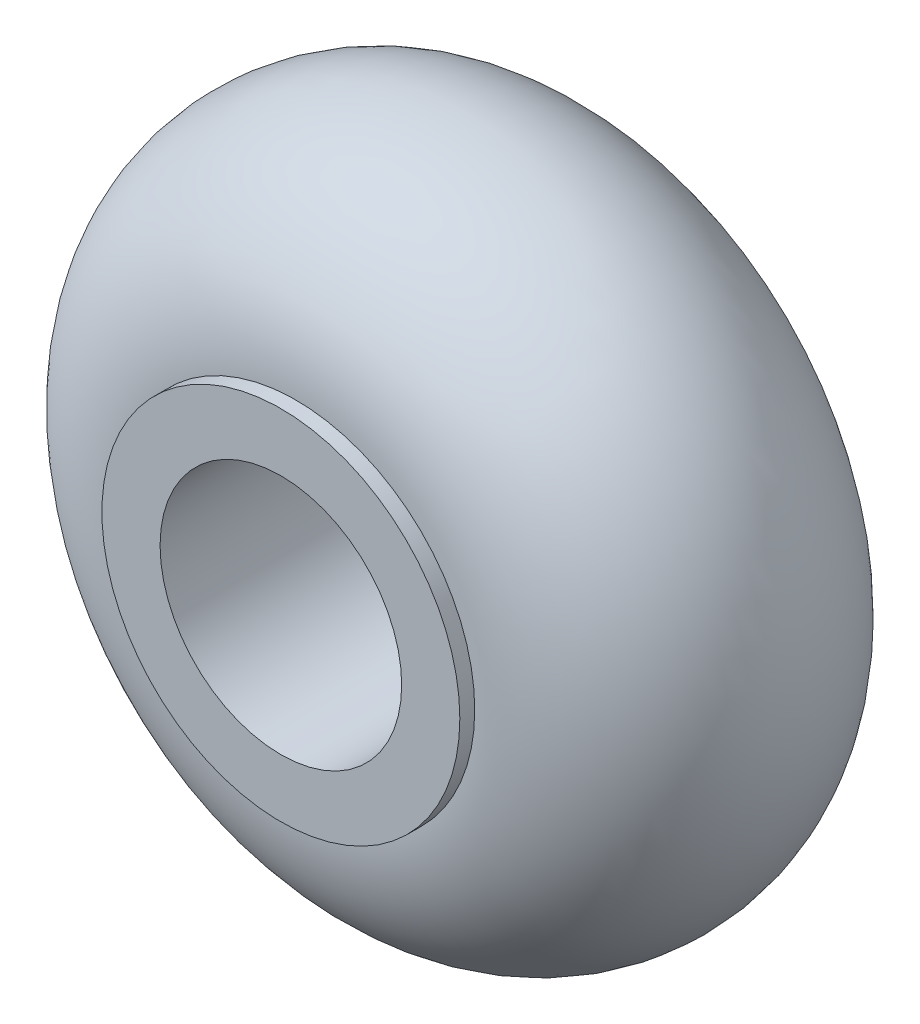
ISO-10303-21;
HEADER;
FILE_DESCRIPTION(('STEP AP214'),'2;1');
FILE_NAME('part.step','',(''),(''),'','','');
FILE_SCHEMA(('AUTOMOTIVE_DESIGN { 1 0 10303 214 1 1 1 1 }'));
ENDSEC;
DATA;
#1=APPLICATION_CONTEXT('core data for automotive mechanical design processes');
#2=APPLICATION_PROTOCOL_DEFINITION('international standard','automotive_design',2000,#1);
#3=PRODUCT_CONTEXT('',#1,'mechanical');
#4=PRODUCT('Part','Part','',(#3));
#5=PRODUCT_RELATED_PRODUCT_CATEGORY('part','',(#4));
#6=PRODUCT_DEFINITION_FORMATION('','',#4);
#7=PRODUCT_DEFINITION_CONTEXT('part definition',#1,'design');
#8=PRODUCT_DEFINITION('design','',#6,#7);
#9=PRODUCT_DEFINITION_SHAPE('','',#8);
#10=(LENGTH_UNIT() NAMED_UNIT(*) SI_UNIT(.MILLI.,.METRE.));
#11=(NAMED_UNIT(*) PLANE_ANGLE_UNIT() SI_UNIT($,.RADIAN.));
#12=(NAMED_UNIT(*) SI_UNIT($,.STERADIAN.) SOLID_ANGLE_UNIT());
#13=UNCERTAINTY_MEASURE_WITH_UNIT(LENGTH_MEASURE(1.E-05),#10,'distance_accuracy_value','');
#14=(GEOMETRIC_REPRESENTATION_CONTEXT(3) GLOBAL_UNCERTAINTY_ASSIGNED_CONTEXT((#13)) GLOBAL_UNIT_ASSIGNED_CONTEXT((#10,
#11,#12)) REPRESENTATION_CONTEXT('',''));
#15=CARTESIAN_POINT('',(0.,0.,0.));
#16=DIRECTION('',(0.,0.,1.));
#17=DIRECTION('',(1.,0.,0.));
#18=AXIS2_PLACEMENT_3D('',#15,#16,#17);
#19=CARTESIAN_POINT('',(0.,0.,0.));
#20=DIRECTION('',(0.,0.,1.));
#21=DIRECTION('',(1.,0.,0.));
#22=AXIS2_PLACEMENT_3D('',#19,#20,#21);
#23=TOROIDAL_SURFACE('',#22,6.08173076923084,5.50060723180987);
#24=CARTESIAN_POINT('',(0.,0.,5.5));
#25=DIRECTION('',(0.,0.,1.));
#26=DIRECTION('',(1.,0.,0.));
#27=AXIS2_PLACEMENT_3D('',#24,#25,#26);
#28=CIRCLE('',#27,6.);
#29=CARTESIAN_POINT('',(6.,0.,5.5));
#30=VERTEX_POINT('',#29);
#31=EDGE_CURVE('E10',#30,#30,#28,.T.);
#32=ORIENTED_EDGE('',*,*,#31,.F.);
#33=EDGE_LOOP('',(#32));
#34=FACE_BOUND('',#33,.T.);
#35=CARTESIAN_POINT('',(0.,0.,-5.5));
#36=DIRECTION('',(0.,0.,1.));
#37=DIRECTION('',(1.,0.,0.));
#38=AXIS2_PLACEMENT_3D('',#35,#36,#37);
#39=CIRCLE('',#38,6.00000000000012);
#40=CARTESIAN_POINT('',(6.00000000000012,0.,-5.5));
#41=VERTEX_POINT('',#40);
#42=EDGE_CURVE('E64',#41,#41,#39,.T.);
#43=ORIENTED_EDGE('',*,*,#42,.T.);
#44=EDGE_LOOP('',(#43));
#45=FACE_BOUND('',#44,.T.);
#46=ADVANCED_FACE('F37',(#34,#45),#23,.T.);
#47=CARTESIAN_POINT('',(0.,0.,10.3653846153846));
#48=DIRECTION('',(0.,0.,1.));
#49=DIRECTION('',(1.,0.,0.));
#50=AXIS2_PLACEMENT_3D('',#47,#48,#49);
#51=CYLINDRICAL_SURFACE('',#50,6.);
#52=CARTESIAN_POINT('',(0.,0.,6.));
#53=DIRECTION('',(0.,0.,1.));
#54=DIRECTION('',(1.,0.,0.));
#55=AXIS2_PLACEMENT_3D('',#52,#53,#54);
#56=CIRCLE('',#55,6.);
#57=CARTESIAN_POINT('',(6.,0.,6.));
#58=VERTEX_POINT('',#57);
#59=EDGE_CURVE('E44',#58,#58,#56,.T.);
#60=ORIENTED_EDGE('',*,*,#59,.F.);
#61=EDGE_LOOP('',(#60));
#62=FACE_BOUND('',#61,.T.);
#63=ORIENTED_EDGE('',*,*,#31,.T.);
#64=EDGE_LOOP('',(#63));
#65=FACE_BOUND('',#64,.T.);
#66=ADVANCED_FACE('F90',(#62,#65),#51,.T.);
#67=CARTESIAN_POINT('',(0.,6.,6.));
#68=DIRECTION('',(0.,0.,-1.));
#69=DIRECTION('',(-1.,0.,0.));
#70=AXIS2_PLACEMENT_3D('',#67,#68,#69);
#71=PLANE('',#70);
#72=CARTESIAN_POINT('',(0.,0.,6.));
#73=DIRECTION('',(0.,0.,1.));
#74=DIRECTION('',(1.,0.,0.));
#75=AXIS2_PLACEMENT_3D('',#72,#73,#74);
#76=CIRCLE('',#75,4.05);
#77=CARTESIAN_POINT('',(4.05,0.,6.));
#78=VERTEX_POINT('',#77);
#79=EDGE_CURVE('E49',#78,#78,#76,.T.);
#80=ORIENTED_EDGE('',*,*,#79,.F.);
#81=EDGE_LOOP('',(#80));
#82=FACE_BOUND('',#81,.T.);
#83=ORIENTED_EDGE('',*,*,#59,.T.);
#84=EDGE_LOOP('',(#83));
#85=FACE_BOUND('',#84,.T.);
#86=ADVANCED_FACE('F85',(#82,#85),#71,.F.);
#87=CARTESIAN_POINT('',(0.,0.,10.3653846153846));
#88=DIRECTION('',(0.,0.,1.));
#89=DIRECTION('',(1.,0.,0.));
#90=AXIS2_PLACEMENT_3D('',#87,#88,#89);
#91=CYLINDRICAL_SURFACE('',#90,4.05);
#92=CARTESIAN_POINT('',(0.,0.,-6.00000000000001));
#93=DIRECTION('',(0.,0.,1.));
#94=DIRECTION('',(1.,0.,0.));
#95=AXIS2_PLACEMENT_3D('',#92,#93,#94);
#96=CIRCLE('',#95,4.05);
#97=CARTESIAN_POINT('',(4.05,0.,-6.00000000000001));
#98=VERTEX_POINT('',#97);
#99=EDGE_CURVE('E54',#98,#98,#96,.T.);
#100=ORIENTED_EDGE('',*,*,#99,.F.);
#101=EDGE_LOOP('',(#100));
#102=FACE_BOUND('',#101,.T.);
#103=ORIENTED_EDGE('',*,*,#79,.T.);
#104=EDGE_LOOP('',(#103));
#105=FACE_BOUND('',#104,.T.);
#106=ADVANCED_FACE('F79',(#102,#105),#91,.F.);
#107=CARTESIAN_POINT('',(0.,4.05,-6.00000000000001));
#108=DIRECTION('',(0.,0.,1.));
#109=DIRECTION('',(1.,0.,0.));
#110=AXIS2_PLACEMENT_3D('',#107,#108,#109);
#111=PLANE('',#110);
#112=CARTESIAN_POINT('',(0.,0.,-6.));
#113=DIRECTION('',(0.,0.,1.));
#114=DIRECTION('',(1.,0.,0.));
#115=AXIS2_PLACEMENT_3D('',#112,#113,#114);
#116=CIRCLE('',#115,6.00000000000012);
#117=CARTESIAN_POINT('',(6.00000000000012,0.,-6.));
#118=VERTEX_POINT('',#117);
#119=EDGE_CURVE('E60',#118,#118,#116,.T.);
#120=ORIENTED_EDGE('',*,*,#119,.F.);
#121=EDGE_LOOP('',(#120));
#122=FACE_BOUND('',#121,.T.);
#123=ORIENTED_EDGE('',*,*,#99,.T.);
#124=EDGE_LOOP('',(#123));
#125=FACE_BOUND('',#124,.T.);
#126=ADVANCED_FACE('F73',(#122,#125),#111,.F.);
#127=CARTESIAN_POINT('',(0.,0.,10.3653846153846));
#128=DIRECTION('',(0.,0.,1.));
#129=DIRECTION('',(1.,0.,0.));
#130=AXIS2_PLACEMENT_3D('',#127,#128,#129);
#131=CYLINDRICAL_SURFACE('',#130,6.00000000000012);
#132=ORIENTED_EDGE('',*,*,#42,.F.);
#133=EDGE_LOOP('',(#132));
#134=FACE_BOUND('',#133,.T.);
#135=ORIENTED_EDGE('',*,*,#119,.T.);
#136=EDGE_LOOP('',(#135));
#137=FACE_BOUND('',#136,.T.);
#138=ADVANCED_FACE('F70',(#134,#137),#131,.T.);
#139=CLOSED_SHELL('',(#46,#66,#86,#106,#126,#138));
#140=MANIFOLD_SOLID_BREP('B2',#139);
#141=ADVANCED_BREP_SHAPE_REPRESENTATION('',(#18,#140),#14);
#142=SHAPE_DEFINITION_REPRESENTATION(#9,#141);
ENDSEC;
END-ISO-10303-21;
